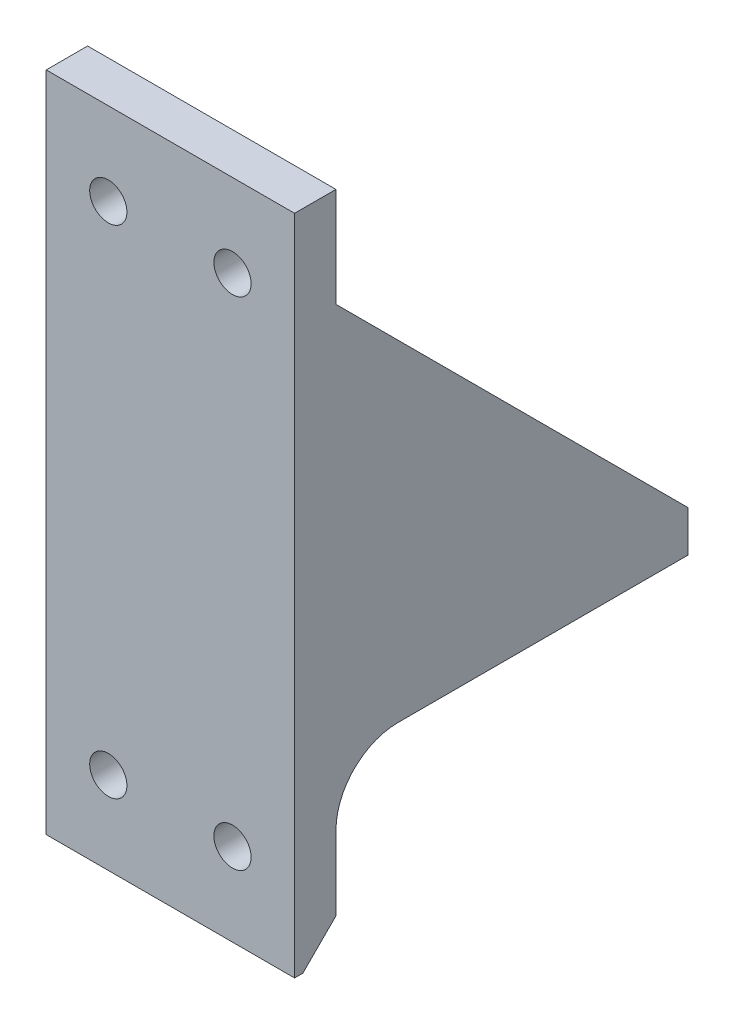
ISO-10303-21;
HEADER;
FILE_DESCRIPTION(('STEP AP214'),'2;1');
FILE_NAME('part.step','',(''),(''),'','','');
FILE_SCHEMA(('AUTOMOTIVE_DESIGN { 1 0 10303 214 1 1 1 1 }'));
ENDSEC;
DATA;
#1=APPLICATION_CONTEXT('core data for automotive mechanical design processes');
#2=APPLICATION_PROTOCOL_DEFINITION('international standard','automotive_design',2000,#1);
#3=PRODUCT_CONTEXT('',#1,'mechanical');
#4=PRODUCT('Part','Part','',(#3));
#5=PRODUCT_RELATED_PRODUCT_CATEGORY('part','',(#4));
#6=PRODUCT_DEFINITION_FORMATION('','',#4);
#7=PRODUCT_DEFINITION_CONTEXT('part definition',#1,'design');
#8=PRODUCT_DEFINITION('design','',#6,#7);
#9=PRODUCT_DEFINITION_SHAPE('','',#8);
#10=(LENGTH_UNIT() NAMED_UNIT(*) SI_UNIT(.MILLI.,.METRE.));
#11=(NAMED_UNIT(*) PLANE_ANGLE_UNIT() SI_UNIT($,.RADIAN.));
#12=(NAMED_UNIT(*) SI_UNIT($,.STERADIAN.) SOLID_ANGLE_UNIT());
#13=UNCERTAINTY_MEASURE_WITH_UNIT(LENGTH_MEASURE(1.E-05),#10,'distance_accuracy_value','');
#14=(GEOMETRIC_REPRESENTATION_CONTEXT(3) GLOBAL_UNCERTAINTY_ASSIGNED_CONTEXT((#13)) GLOBAL_UNIT_ASSIGNED_CONTEXT((#10,
#11,#12)) REPRESENTATION_CONTEXT('',''));
#15=CARTESIAN_POINT('',(0.,0.,0.));
#16=DIRECTION('',(0.,0.,1.));
#17=DIRECTION('',(1.,0.,0.));
#18=AXIS2_PLACEMENT_3D('',#15,#16,#17);
#19=CARTESIAN_POINT('',(157.475487839819,-29.048,-85.));
#20=DIRECTION('',(0.,-0.707106781186552,0.707106781186544));
#21=DIRECTION('',(0.,-0.707106781186544,-0.707106781186552));
#22=AXIS2_PLACEMENT_3D('',#19,#20,#21);
#23=PLANE('',#22);
#24=CARTESIAN_POINT('',(10.31875,21.1957499999994,-34.75625));
#25=DIRECTION('',(0.,-0.707106781186552,0.707106781186544));
#26=DIRECTION('',(0.,0.707106781186544,0.707106781186552));
#27=AXIS2_PLACEMENT_3D('',#24,#25,#26);
#28=ELLIPSE('',#27,10.6066017177981,7.5);
#29=CARTESIAN_POINT('',(10.31875,28.6957499999993,-27.25625));
#30=VERTEX_POINT('',#29);
#31=EDGE_CURVE('E279',#30,#30,#28,.T.);
#32=ORIENTED_EDGE('',*,*,#31,.T.);
#33=EDGE_LOOP('',(#32));
#34=FACE_BOUND('',#33,.T.);
#35=CARTESIAN_POINT('',(10.31875,-18.4917500000001,-74.44375));
#36=DIRECTION('',(0.,-0.707106781186552,0.707106781186544));
#37=DIRECTION('',(0.,0.707106781186544,0.707106781186552));
#38=AXIS2_PLACEMENT_3D('',#35,#36,#37);
#39=ELLIPSE('',#38,10.6066017177982,7.5);
#40=CARTESIAN_POINT('',(10.31875,-10.9917500000002,-66.94375));
#41=VERTEX_POINT('',#40);
#42=EDGE_CURVE('E275',#41,#41,#39,.T.);
#43=ORIENTED_EDGE('',*,*,#42,.T.);
#44=EDGE_LOOP('',(#43));
#45=FACE_BOUND('',#44,.T.);
#46=CARTESIAN_POINT('',(-10.31875,-18.4917500000001,-74.44375));
#47=DIRECTION('',(0.,-0.707106781186552,0.707106781186544));
#48=DIRECTION('',(0.,0.707106781186544,0.707106781186552));
#49=AXIS2_PLACEMENT_3D('',#46,#47,#48);
#50=ELLIPSE('',#49,10.6066017177982,7.50000000000001);
#51=CARTESIAN_POINT('',(-10.31875,-10.9917500000002,-66.94375));
#52=VERTEX_POINT('',#51);
#53=EDGE_CURVE('E271',#52,#52,#50,.T.);
#54=ORIENTED_EDGE('',*,*,#53,.T.);
#55=EDGE_LOOP('',(#54));
#56=FACE_BOUND('',#55,.T.);
#57=CARTESIAN_POINT('',(-10.31875,21.1957499999994,-34.75625));
#58=DIRECTION('',(0.,-0.707106781186552,0.707106781186544));
#59=DIRECTION('',(0.,0.707106781186544,0.707106781186552));
#60=AXIS2_PLACEMENT_3D('',#57,#58,#59);
#61=ELLIPSE('',#60,10.6066017177982,7.5);
#62=CARTESIAN_POINT('',(-10.31875,28.6957499999993,-27.25625));
#63=VERTEX_POINT('',#62);
#64=EDGE_CURVE('E267',#63,#63,#61,.T.);
#65=ORIENTED_EDGE('',*,*,#64,.T.);
#66=EDGE_LOOP('',(#65));
#67=FACE_BOUND('',#66,.T.);
#68=CARTESIAN_POINT('',(15.,60.,4.048000000001));
#69=DIRECTION('',(0.,-0.707106781186552,0.707106781186544));
#70=DIRECTION('',(0.,0.707106781186544,0.707106781186552));
#71=AXIS2_PLACEMENT_3D('',#68,#69,#70);
#72=ELLIPSE('',#71,10.6066017177983,7.5);
#73=CARTESIAN_POINT('',(21.3137703474226,55.951999999999,0.));
#74=VERTEX_POINT('',#73);
#75=CARTESIAN_POINT('',(8.68622965257746,55.951999999999,0.));
#76=VERTEX_POINT('',#75);
#77=EDGE_CURVE('E140',#74,#76,#72,.F.);
#78=ORIENTED_EDGE('',*,*,#77,.F.);
#79=DIRECTION('',(-1.,0.,0.));
#80=VECTOR('',#79,1.);
#81=CARTESIAN_POINT('',(157.475487839819,55.951999999999,0.));
#82=LINE('',#81,#80);
#83=CARTESIAN_POINT('',(30.,55.951999999999,0.));
#84=VERTEX_POINT('',#83);
#85=EDGE_CURVE('E152',#84,#74,#82,.T.);
#86=ORIENTED_EDGE('',*,*,#85,.F.);
#87=DIRECTION('',(0.,-0.707106781186544,-0.707106781186552));
#88=VECTOR('',#87,1.);
#89=CARTESIAN_POINT('',(30.,-29.048,-85.));
#90=LINE('',#89,#88);
#91=CARTESIAN_POINT('',(30.,-29.048,-85.));
#92=VERTEX_POINT('',#91);
#93=EDGE_CURVE('E195',#84,#92,#90,.T.);
#94=ORIENTED_EDGE('',*,*,#93,.T.);
#95=DIRECTION('',(-1.,0.,0.));
#96=VECTOR('',#95,1.);
#97=CARTESIAN_POINT('',(157.475487839819,-29.048,-85.));
#98=LINE('',#97,#96);
#99=CARTESIAN_POINT('',(-30.,-29.048,-85.));
#100=VERTEX_POINT('',#99);
#101=EDGE_CURVE('E165',#92,#100,#98,.T.);
#102=ORIENTED_EDGE('',*,*,#101,.T.);
#103=DIRECTION('',(0.,-0.707106781186544,-0.707106781186552));
#104=VECTOR('',#103,1.);
#105=CARTESIAN_POINT('',(-30.,-29.048,-85.));
#106=LINE('',#105,#104);
#107=CARTESIAN_POINT('',(-30.,55.951999999999,0.));
#108=VERTEX_POINT('',#107);
#109=EDGE_CURVE('E174',#108,#100,#106,.T.);
#110=ORIENTED_EDGE('',*,*,#109,.F.);
#111=CARTESIAN_POINT('',(-21.3137703474225,55.951999999999,0.));
#112=VERTEX_POINT('',#111);
#113=EDGE_CURVE('E167',#112,#108,#82,.T.);
#114=ORIENTED_EDGE('',*,*,#113,.F.);
#115=CARTESIAN_POINT('',(-15.,60.,4.04800000000098));
#116=DIRECTION('',(0.,-0.707106781186552,0.707106781186544));
#117=DIRECTION('',(0.,0.707106781186544,0.707106781186552));
#118=AXIS2_PLACEMENT_3D('',#115,#116,#117);
#119=ELLIPSE('',#118,10.6066017177983,7.5);
#120=CARTESIAN_POINT('',(-8.68622965257744,55.951999999999,0.));
#121=VERTEX_POINT('',#120);
#122=EDGE_CURVE('E158',#121,#112,#119,.F.);
#123=ORIENTED_EDGE('',*,*,#122,.F.);
#124=EDGE_CURVE('E155',#76,#121,#82,.T.);
#125=ORIENTED_EDGE('',*,*,#124,.F.);
#126=EDGE_LOOP('',(#78,#86,#94,#102,#110,#114,#123,#125));
#127=FACE_BOUND('',#126,.T.);
#128=ADVANCED_FACE('F49',(#34,#45,#56,#67,#127),#23,.F.);
#129=CARTESIAN_POINT('',(10.31875,80.001,-34.75625));
#130=DIRECTION('',(0.,-1.,0.));
#131=DIRECTION('',(0.,0.,-1.));
#132=AXIS2_PLACEMENT_3D('',#129,#130,#131);
#133=CYLINDRICAL_SURFACE('',#132,2.38000000000001);
#134=CARTESIAN_POINT('',(10.31875,-39.048,-34.75625));
#135=DIRECTION('',(0.,-1.,0.));
#136=DIRECTION('',(0.,0.,-1.));
#137=AXIS2_PLACEMENT_3D('',#134,#135,#136);
#138=CIRCLE('',#137,2.38000000000001);
#139=CARTESIAN_POINT('',(10.31875,-39.048,-37.13625));
#140=VERTEX_POINT('',#139);
#141=EDGE_CURVE('E632',#140,#140,#138,.T.);
#142=ORIENTED_EDGE('',*,*,#141,.T.);
#143=EDGE_LOOP('',(#142));
#144=FACE_BOUND('',#143,.T.);
#145=CARTESIAN_POINT('',(10.31875,-34.048,-34.75625));
#146=DIRECTION('',(0.,1.,0.));
#147=DIRECTION('',(0.,0.,1.));
#148=AXIS2_PLACEMENT_3D('',#145,#146,#147);
#149=CIRCLE('',#148,2.38000000000001);
#150=CARTESIAN_POINT('',(10.31875,-34.048,-32.37625));
#151=VERTEX_POINT('',#150);
#152=EDGE_CURVE('E263',#151,#151,#149,.F.);
#153=ORIENTED_EDGE('',*,*,#152,.F.);
#154=EDGE_LOOP('',(#153));
#155=FACE_BOUND('',#154,.T.);
#156=ADVANCED_FACE('F330',(#144,#155),#133,.F.);
#157=CARTESIAN_POINT('',(-10.31875,80.001,-74.44375));
#158=DIRECTION('',(0.,-1.,0.));
#159=DIRECTION('',(0.,0.,-1.));
#160=AXIS2_PLACEMENT_3D('',#157,#158,#159);
#161=CYLINDRICAL_SURFACE('',#160,2.38);
#162=CARTESIAN_POINT('',(-10.31875,-39.048,-74.44375));
#163=DIRECTION('',(0.,-1.,0.));
#164=DIRECTION('',(0.,0.,-1.));
#165=AXIS2_PLACEMENT_3D('',#162,#163,#164);
#166=CIRCLE('',#165,2.38);
#167=CARTESIAN_POINT('',(-10.31875,-39.048,-76.82375));
#168=VERTEX_POINT('',#167);
#169=EDGE_CURVE('E623',#168,#168,#166,.T.);
#170=ORIENTED_EDGE('',*,*,#169,.T.);
#171=EDGE_LOOP('',(#170));
#172=FACE_BOUND('',#171,.T.);
#173=CARTESIAN_POINT('',(-10.31875,-34.048,-74.44375));
#174=DIRECTION('',(0.,1.,0.));
#175=DIRECTION('',(0.,0.,1.));
#176=AXIS2_PLACEMENT_3D('',#173,#174,#175);
#177=CIRCLE('',#176,2.38);
#178=CARTESIAN_POINT('',(-10.31875,-34.048,-72.06375));
#179=VERTEX_POINT('',#178);
#180=EDGE_CURVE('E259',#179,#179,#177,.F.);
#181=ORIENTED_EDGE('',*,*,#180,.F.);
#182=EDGE_LOOP('',(#181));
#183=FACE_BOUND('',#182,.T.);
#184=ADVANCED_FACE('F338',(#172,#183),#161,.F.);
#185=CARTESIAN_POINT('',(10.31875,80.001,-74.44375));
#186=DIRECTION('',(0.,-1.,0.));
#187=DIRECTION('',(0.,0.,-1.));
#188=AXIS2_PLACEMENT_3D('',#185,#186,#187);
#189=CYLINDRICAL_SURFACE('',#188,2.37999999999999);
#190=CARTESIAN_POINT('',(10.31875,-39.048,-74.44375));
#191=DIRECTION('',(0.,-1.,0.));
#192=DIRECTION('',(0.,0.,-1.));
#193=AXIS2_PLACEMENT_3D('',#190,#191,#192);
#194=CIRCLE('',#193,2.37999999999999);
#195=CARTESIAN_POINT('',(10.31875,-39.048,-76.82375));
#196=VERTEX_POINT('',#195);
#197=EDGE_CURVE('E627',#196,#196,#194,.T.);
#198=ORIENTED_EDGE('',*,*,#197,.T.);
#199=EDGE_LOOP('',(#198));
#200=FACE_BOUND('',#199,.T.);
#201=CARTESIAN_POINT('',(10.31875,-34.048,-74.44375));
#202=DIRECTION('',(0.,1.,0.));
#203=DIRECTION('',(0.,0.,1.));
#204=AXIS2_PLACEMENT_3D('',#201,#202,#203);
#205=CIRCLE('',#204,2.37999999999999);
#206=CARTESIAN_POINT('',(10.31875,-34.048,-72.06375));
#207=VERTEX_POINT('',#206);
#208=EDGE_CURVE('E254',#207,#207,#205,.F.);
#209=ORIENTED_EDGE('',*,*,#208,.F.);
#210=EDGE_LOOP('',(#209));
#211=FACE_BOUND('',#210,.T.);
#212=ADVANCED_FACE('F412',(#200,#211),#189,.F.);
#213=CARTESIAN_POINT('',(-10.31875,80.001,-34.75625));
#214=DIRECTION('',(0.,-1.,0.));
#215=DIRECTION('',(0.,0.,-1.));
#216=AXIS2_PLACEMENT_3D('',#213,#214,#215);
#217=CYLINDRICAL_SURFACE('',#216,2.38);
#218=CARTESIAN_POINT('',(-10.31875,-39.048,-34.75625));
#219=DIRECTION('',(0.,-1.,0.));
#220=DIRECTION('',(0.,0.,-1.));
#221=AXIS2_PLACEMENT_3D('',#218,#219,#220);
#222=CIRCLE('',#221,2.38);
#223=CARTESIAN_POINT('',(-10.31875,-39.048,-37.13625));
#224=VERTEX_POINT('',#223);
#225=EDGE_CURVE('E628',#224,#224,#222,.T.);
#226=ORIENTED_EDGE('',*,*,#225,.T.);
#227=EDGE_LOOP('',(#226));
#228=FACE_BOUND('',#227,.T.);
#229=CARTESIAN_POINT('',(-10.31875,-34.048,-34.75625));
#230=DIRECTION('',(0.,1.,0.));
#231=DIRECTION('',(0.,0.,1.));
#232=AXIS2_PLACEMENT_3D('',#229,#230,#231);
#233=CIRCLE('',#232,2.38);
#234=CARTESIAN_POINT('',(-10.31875,-34.048,-32.37625));
#235=VERTEX_POINT('',#234);
#236=EDGE_CURVE('E250',#235,#235,#233,.F.);
#237=ORIENTED_EDGE('',*,*,#236,.F.);
#238=EDGE_LOOP('',(#237));
#239=FACE_BOUND('',#238,.T.);
#240=ADVANCED_FACE('F420',(#228,#239),#217,.F.);
#241=CARTESIAN_POINT('',(0.,0.,0.));
#242=DIRECTION('',(0.,0.,-1.));
#243=DIRECTION('',(-1.,0.,0.));
#244=AXIS2_PLACEMENT_3D('',#241,#242,#243);
#245=PLANE('',#244);
#246=ORIENTED_EDGE('',*,*,#85,.T.);
#247=CARTESIAN_POINT('',(15.,60.,0.));
#248=DIRECTION('',(0.,0.,-1.));
#249=DIRECTION('',(-1.,0.,0.));
#250=AXIS2_PLACEMENT_3D('',#247,#248,#249);
#251=CIRCLE('',#250,7.5);
#252=EDGE_CURVE('E137',#74,#76,#251,.T.);
#253=ORIENTED_EDGE('',*,*,#252,.T.);
#254=ORIENTED_EDGE('',*,*,#124,.T.);
#255=CARTESIAN_POINT('',(-15.,60.,0.));
#256=DIRECTION('',(0.,0.,-1.));
#257=DIRECTION('',(-1.,0.,0.));
#258=AXIS2_PLACEMENT_3D('',#255,#256,#257);
#259=CIRCLE('',#258,7.5);
#260=EDGE_CURVE('E147',#121,#112,#259,.T.);
#261=ORIENTED_EDGE('',*,*,#260,.T.);
#262=ORIENTED_EDGE('',*,*,#113,.T.);
#263=DIRECTION('',(0.,-1.,0.));
#264=VECTOR('',#263,1.);
#265=CARTESIAN_POINT('',(-30.,-80.,0.));
#266=LINE('',#265,#264);
#267=CARTESIAN_POINT('',(-30.,80.,0.));
#268=VERTEX_POINT('',#267);
#269=EDGE_CURVE('E216',#268,#108,#266,.T.);
#270=ORIENTED_EDGE('',*,*,#269,.F.);
#271=DIRECTION('',(-1.,0.,0.));
#272=VECTOR('',#271,1.);
#273=CARTESIAN_POINT('',(-30.,80.,0.));
#274=LINE('',#273,#272);
#275=CARTESIAN_POINT('',(30.,80.,0.));
#276=VERTEX_POINT('',#275);
#277=EDGE_CURVE('E208',#276,#268,#274,.T.);
#278=ORIENTED_EDGE('',*,*,#277,.F.);
#279=DIRECTION('',(0.,1.,0.));
#280=VECTOR('',#279,1.);
#281=CARTESIAN_POINT('',(30.,-80.,0.));
#282=LINE('',#281,#280);
#283=EDGE_CURVE('E163',#84,#276,#282,.T.);
#284=ORIENTED_EDGE('',*,*,#283,.F.);
#285=EDGE_LOOP('',(#246,#253,#254,#261,#262,#270,#278,#284));
#286=FACE_BOUND('',#285,.T.);
#287=CARTESIAN_POINT('',(-15.,60.,0.));
#288=DIRECTION('',(0.,0.,-1.));
#289=DIRECTION('',(-1.,0.,0.));
#290=AXIS2_PLACEMENT_3D('',#287,#288,#289);
#291=CIRCLE('',#290,4.50000000000001);
#292=CARTESIAN_POINT('',(-19.5,60.,0.));
#293=VERTEX_POINT('',#292);
#294=EDGE_CURVE('E603',#293,#293,#291,.T.);
#295=ORIENTED_EDGE('',*,*,#294,.F.);
#296=EDGE_LOOP('',(#295));
#297=FACE_BOUND('',#296,.T.);
#298=CARTESIAN_POINT('',(15.,60.,0.));
#299=DIRECTION('',(0.,0.,-1.));
#300=DIRECTION('',(-1.,0.,0.));
#301=AXIS2_PLACEMENT_3D('',#298,#299,#300);
#302=CIRCLE('',#301,4.50000000000001);
#303=CARTESIAN_POINT('',(10.5,60.,0.));
#304=VERTEX_POINT('',#303);
#305=EDGE_CURVE('E597',#304,#304,#302,.T.);
#306=ORIENTED_EDGE('',*,*,#305,.F.);
#307=EDGE_LOOP('',(#306));
#308=FACE_BOUND('',#307,.T.);
#309=ADVANCED_FACE('F160',(#286,#297,#308),#245,.T.);
#310=CARTESIAN_POINT('',(30.,-80.,10.));
#311=DIRECTION('',(-1.,0.,0.));
#312=DIRECTION('',(0.,0.,1.));
#313=AXIS2_PLACEMENT_3D('',#310,#311,#312);
#314=PLANE('',#313);
#315=DIRECTION('',(0.,0.,-1.));
#316=VECTOR('',#315,1.);
#317=CARTESIAN_POINT('',(30.,-80.,10.));
#318=LINE('',#317,#316);
#319=CARTESIAN_POINT('',(30.,-80.,10.));
#320=VERTEX_POINT('',#319);
#321=CARTESIAN_POINT('',(30.,-80.,8.00000000000004));
#322=VERTEX_POINT('',#321);
#323=EDGE_CURVE('E220',#320,#322,#318,.T.);
#324=ORIENTED_EDGE('',*,*,#323,.T.);
#325=DIRECTION('',(0.,0.707106781186549,-0.707106781186546));
#326=VECTOR('',#325,1.);
#327=CARTESIAN_POINT('',(30.,-80.,8.00000000000004));
#328=LINE('',#327,#326);
#329=CARTESIAN_POINT('',(30.,-72.,0.));
#330=VERTEX_POINT('',#329);
#331=EDGE_CURVE('E240',#322,#330,#328,.T.);
#332=ORIENTED_EDGE('',*,*,#331,.T.);
#333=CARTESIAN_POINT('',(30.,-54.048,0.));
#334=VERTEX_POINT('',#333);
#335=EDGE_CURVE('E203',#330,#334,#282,.T.);
#336=ORIENTED_EDGE('',*,*,#335,.T.);
#337=CARTESIAN_POINT('',(30.,-54.048,-15.));
#338=DIRECTION('',(-1.,0.,0.));
#339=DIRECTION('',(0.,0.,1.));
#340=AXIS2_PLACEMENT_3D('',#337,#338,#339);
#341=CIRCLE('',#340,15.);
#342=CARTESIAN_POINT('',(30.,-39.048,-15.));
#343=VERTEX_POINT('',#342);
#344=EDGE_CURVE('E12',#334,#343,#341,.T.);
#345=ORIENTED_EDGE('',*,*,#344,.T.);
#346=DIRECTION('',(0.,0.,1.));
#347=VECTOR('',#346,1.);
#348=CARTESIAN_POINT('',(30.,-39.048,0.));
#349=LINE('',#348,#347);
#350=CARTESIAN_POINT('',(30.,-39.048,-85.));
#351=VERTEX_POINT('',#350);
#352=EDGE_CURVE('E194',#351,#343,#349,.T.);
#353=ORIENTED_EDGE('',*,*,#352,.F.);
#354=DIRECTION('',(0.,-1.,0.));
#355=VECTOR('',#354,1.);
#356=CARTESIAN_POINT('',(30.,-29.048,-85.));
#357=LINE('',#356,#355);
#358=EDGE_CURVE('E191',#92,#351,#357,.T.);
#359=ORIENTED_EDGE('',*,*,#358,.F.);
#360=ORIENTED_EDGE('',*,*,#93,.F.);
#361=ORIENTED_EDGE('',*,*,#283,.T.);
#362=DIRECTION('',(0.,0.,-1.));
#363=VECTOR('',#362,1.);
#364=CARTESIAN_POINT('',(30.,80.,10.));
#365=LINE('',#364,#363);
#366=CARTESIAN_POINT('',(30.,80.,10.));
#367=VERTEX_POINT('',#366);
#368=EDGE_CURVE('E232',#367,#276,#365,.T.);
#369=ORIENTED_EDGE('',*,*,#368,.F.);
#370=DIRECTION('',(0.,1.,0.));
#371=VECTOR('',#370,1.);
#372=CARTESIAN_POINT('',(30.,-80.,10.));
#373=LINE('',#372,#371);
#374=EDGE_CURVE('E219',#320,#367,#373,.T.);
#375=ORIENTED_EDGE('',*,*,#374,.F.);
#376=EDGE_LOOP('',(#324,#332,#336,#345,#353,#359,#360,#361,#369,#375));
#377=FACE_BOUND('',#376,.T.);
#378=ADVANCED_FACE('F313',(#377),#314,.F.);
#379=CARTESIAN_POINT('',(-30.,80.,10.));
#380=DIRECTION('',(0.,-1.,0.));
#381=DIRECTION('',(0.,0.,-1.));
#382=AXIS2_PLACEMENT_3D('',#379,#380,#381);
#383=PLANE('',#382);
#384=ORIENTED_EDGE('',*,*,#277,.T.);
#385=DIRECTION('',(0.,0.,-1.));
#386=VECTOR('',#385,1.);
#387=CARTESIAN_POINT('',(-30.,80.,10.));
#388=LINE('',#387,#386);
#389=CARTESIAN_POINT('',(-30.,80.,10.));
#390=VERTEX_POINT('',#389);
#391=EDGE_CURVE('E228',#390,#268,#388,.T.);
#392=ORIENTED_EDGE('',*,*,#391,.F.);
#393=DIRECTION('',(-1.,0.,0.));
#394=VECTOR('',#393,1.);
#395=CARTESIAN_POINT('',(-30.,80.,10.));
#396=LINE('',#395,#394);
#397=EDGE_CURVE('E294',#367,#390,#396,.T.);
#398=ORIENTED_EDGE('',*,*,#397,.F.);
#399=ORIENTED_EDGE('',*,*,#368,.T.);
#400=EDGE_LOOP('',(#384,#392,#398,#399));
#401=FACE_BOUND('',#400,.T.);
#402=ADVANCED_FACE('F319',(#401),#383,.F.);
#403=CARTESIAN_POINT('',(-30.,-80.,10.));
#404=DIRECTION('',(1.,0.,0.));
#405=DIRECTION('',(0.,0.,-1.));
#406=AXIS2_PLACEMENT_3D('',#403,#404,#405);
#407=PLANE('',#406);
#408=DIRECTION('',(0.,0.,1.));
#409=VECTOR('',#408,1.);
#410=CARTESIAN_POINT('',(-30.,-39.048,0.));
#411=LINE('',#410,#409);
#412=CARTESIAN_POINT('',(-30.,-39.048,-85.));
#413=VERTEX_POINT('',#412);
#414=CARTESIAN_POINT('',(-30.,-39.048,-15.));
#415=VERTEX_POINT('',#414);
#416=EDGE_CURVE('E187',#413,#415,#411,.T.);
#417=ORIENTED_EDGE('',*,*,#416,.T.);
#418=CARTESIAN_POINT('',(-30.,-54.048,-15.));
#419=DIRECTION('',(1.,0.,0.));
#420=DIRECTION('',(0.,0.,-1.));
#421=AXIS2_PLACEMENT_3D('',#418,#419,#420);
#422=CIRCLE('',#421,15.);
#423=CARTESIAN_POINT('',(-30.,-54.048,0.));
#424=VERTEX_POINT('',#423);
#425=EDGE_CURVE('E58',#415,#424,#422,.T.);
#426=ORIENTED_EDGE('',*,*,#425,.T.);
#427=CARTESIAN_POINT('',(-30.,-72.,0.));
#428=VERTEX_POINT('',#427);
#429=EDGE_CURVE('E215',#424,#428,#266,.T.);
#430=ORIENTED_EDGE('',*,*,#429,.T.);
#431=DIRECTION('',(0.,-0.707106781186549,0.707106781186546));
#432=VECTOR('',#431,1.);
#433=CARTESIAN_POINT('',(-30.,-80.,8.00000000000004));
#434=LINE('',#433,#432);
#435=CARTESIAN_POINT('',(-30.,-80.,8.00000000000004));
#436=VERTEX_POINT('',#435);
#437=EDGE_CURVE('E247',#428,#436,#434,.T.);
#438=ORIENTED_EDGE('',*,*,#437,.T.);
#439=DIRECTION('',(0.,0.,-1.));
#440=VECTOR('',#439,1.);
#441=CARTESIAN_POINT('',(-30.,-80.,10.));
#442=LINE('',#441,#440);
#443=CARTESIAN_POINT('',(-30.,-80.,10.));
#444=VERTEX_POINT('',#443);
#445=EDGE_CURVE('E224',#444,#436,#442,.T.);
#446=ORIENTED_EDGE('',*,*,#445,.F.);
#447=DIRECTION('',(0.,-1.,0.));
#448=VECTOR('',#447,1.);
#449=CARTESIAN_POINT('',(-30.,-80.,10.));
#450=LINE('',#449,#448);
#451=EDGE_CURVE('E292',#390,#444,#450,.T.);
#452=ORIENTED_EDGE('',*,*,#451,.F.);
#453=ORIENTED_EDGE('',*,*,#391,.T.);
#454=ORIENTED_EDGE('',*,*,#269,.T.);
#455=ORIENTED_EDGE('',*,*,#109,.T.);
#456=DIRECTION('',(0.,-1.,0.));
#457=VECTOR('',#456,1.);
#458=CARTESIAN_POINT('',(-30.,-29.048,-85.));
#459=LINE('',#458,#457);
#460=EDGE_CURVE('E181',#100,#413,#459,.T.);
#461=ORIENTED_EDGE('',*,*,#460,.T.);
#462=EDGE_LOOP('',(#417,#426,#430,#438,#446,#452,#453,#454,#455,#461));
#463=FACE_BOUND('',#462,.T.);
#464=ADVANCED_FACE('F300',(#463),#407,.F.);
#465=CARTESIAN_POINT('',(-30.,-80.,10.));
#466=DIRECTION('',(0.,1.,0.));
#467=DIRECTION('',(0.,0.,1.));
#468=AXIS2_PLACEMENT_3D('',#465,#466,#467);
#469=PLANE('',#468);
#470=ORIENTED_EDGE('',*,*,#445,.T.);
#471=DIRECTION('',(1.,0.,0.));
#472=VECTOR('',#471,1.);
#473=CARTESIAN_POINT('',(30.,-80.,8.00000000000004));
#474=LINE('',#473,#472);
#475=EDGE_CURVE('E236',#436,#322,#474,.T.);
#476=ORIENTED_EDGE('',*,*,#475,.T.);
#477=ORIENTED_EDGE('',*,*,#323,.F.);
#478=DIRECTION('',(1.,0.,0.));
#479=VECTOR('',#478,1.);
#480=CARTESIAN_POINT('',(-30.,-80.,10.));
#481=LINE('',#480,#479);
#482=EDGE_CURVE('E211',#444,#320,#481,.T.);
#483=ORIENTED_EDGE('',*,*,#482,.F.);
#484=EDGE_LOOP('',(#470,#476,#477,#483));
#485=FACE_BOUND('',#484,.T.);
#486=ADVANCED_FACE('F310',(#485),#469,.F.);
#487=CARTESIAN_POINT('',(0.,0.,10.));
#488=DIRECTION('',(0.,0.,-1.));
#489=DIRECTION('',(-1.,0.,0.));
#490=AXIS2_PLACEMENT_3D('',#487,#488,#489);
#491=PLANE('',#490);
#492=CARTESIAN_POINT('',(-15.,-60.,10.));
#493=DIRECTION('',(0.,0.,-1.));
#494=DIRECTION('',(-1.,0.,0.));
#495=AXIS2_PLACEMENT_3D('',#492,#493,#494);
#496=CIRCLE('',#495,4.50000000000001);
#497=CARTESIAN_POINT('',(-19.5,-60.,10.));
#498=VERTEX_POINT('',#497);
#499=EDGE_CURVE('E607',#498,#498,#496,.F.);
#500=ORIENTED_EDGE('',*,*,#499,.F.);
#501=EDGE_LOOP('',(#500));
#502=FACE_BOUND('',#501,.T.);
#503=CARTESIAN_POINT('',(15.,60.,10.));
#504=DIRECTION('',(0.,0.,-1.));
#505=DIRECTION('',(-1.,0.,0.));
#506=AXIS2_PLACEMENT_3D('',#503,#504,#505);
#507=CIRCLE('',#506,4.50000000000001);
#508=CARTESIAN_POINT('',(10.5,60.,10.));
#509=VERTEX_POINT('',#508);
#510=EDGE_CURVE('E600',#509,#509,#507,.F.);
#511=ORIENTED_EDGE('',*,*,#510,.F.);
#512=EDGE_LOOP('',(#511));
#513=FACE_BOUND('',#512,.T.);
#514=CARTESIAN_POINT('',(-15.,60.,10.));
#515=DIRECTION('',(0.,0.,-1.));
#516=DIRECTION('',(-1.,0.,0.));
#517=AXIS2_PLACEMENT_3D('',#514,#515,#516);
#518=CIRCLE('',#517,4.50000000000001);
#519=CARTESIAN_POINT('',(-19.5,60.,10.));
#520=VERTEX_POINT('',#519);
#521=EDGE_CURVE('E283',#520,#520,#518,.F.);
#522=ORIENTED_EDGE('',*,*,#521,.F.);
#523=EDGE_LOOP('',(#522));
#524=FACE_BOUND('',#523,.T.);
#525=CARTESIAN_POINT('',(15.,-60.,10.));
#526=DIRECTION('',(0.,0.,-1.));
#527=DIRECTION('',(-1.,0.,0.));
#528=AXIS2_PLACEMENT_3D('',#525,#526,#527);
#529=CIRCLE('',#528,4.50000000000001);
#530=CARTESIAN_POINT('',(10.5,-60.,10.));
#531=VERTEX_POINT('',#530);
#532=EDGE_CURVE('E619',#531,#531,#529,.F.);
#533=ORIENTED_EDGE('',*,*,#532,.F.);
#534=EDGE_LOOP('',(#533));
#535=FACE_BOUND('',#534,.T.);
#536=ORIENTED_EDGE('',*,*,#374,.T.);
#537=ORIENTED_EDGE('',*,*,#397,.T.);
#538=ORIENTED_EDGE('',*,*,#451,.T.);
#539=ORIENTED_EDGE('',*,*,#482,.T.);
#540=EDGE_LOOP('',(#536,#537,#538,#539));
#541=FACE_BOUND('',#540,.T.);
#542=ADVANCED_FACE('F315',(#502,#513,#524,#535,#541),#491,.F.);
#543=CARTESIAN_POINT('',(-15.,-60.,0.));
#544=DIRECTION('',(0.,0.,-1.));
#545=DIRECTION('',(-1.,0.,0.));
#546=AXIS2_PLACEMENT_3D('',#543,#544,#545);
#547=CIRCLE('',#546,4.50000000000001);
#548=CARTESIAN_POINT('',(-19.5,-60.,0.));
#549=VERTEX_POINT('',#548);
#550=EDGE_CURVE('E612',#549,#549,#547,.T.);
#551=ORIENTED_EDGE('',*,*,#550,.F.);
#552=EDGE_LOOP('',(#551));
#553=FACE_BOUND('',#552,.T.);
#554=CARTESIAN_POINT('',(15.,-60.,0.));
#555=DIRECTION('',(0.,0.,-1.));
#556=DIRECTION('',(-1.,0.,0.));
#557=AXIS2_PLACEMENT_3D('',#554,#555,#556);
#558=CIRCLE('',#557,4.50000000000001);
#559=CARTESIAN_POINT('',(10.5,-60.,0.));
#560=VERTEX_POINT('',#559);
#561=EDGE_CURVE('E615',#560,#560,#558,.T.);
#562=ORIENTED_EDGE('',*,*,#561,.F.);
#563=EDGE_LOOP('',(#562));
#564=FACE_BOUND('',#563,.T.);
#565=ORIENTED_EDGE('',*,*,#429,.F.);
#566=DIRECTION('',(-1.,0.,0.));
#567=VECTOR('',#566,1.);
#568=CARTESIAN_POINT('',(0.,-54.048,0.));
#569=LINE('',#568,#567);
#570=EDGE_CURVE('E71',#424,#334,#569,.F.);
#571=ORIENTED_EDGE('',*,*,#570,.T.);
#572=ORIENTED_EDGE('',*,*,#335,.F.);
#573=DIRECTION('',(-1.,0.,0.));
#574=VECTOR('',#573,1.);
#575=CARTESIAN_POINT('',(-30.,-72.,0.));
#576=LINE('',#575,#574);
#577=EDGE_CURVE('E243',#330,#428,#576,.T.);
#578=ORIENTED_EDGE('',*,*,#577,.T.);
#579=EDGE_LOOP('',(#565,#571,#572,#578));
#580=FACE_BOUND('',#579,.T.);
#581=ADVANCED_FACE('F304',(#553,#564,#580),#245,.T.);
#582=CARTESIAN_POINT('',(157.475487839819,-29.048,-85.));
#583=DIRECTION('',(0.,0.,1.));
#584=DIRECTION('',(1.,0.,0.));
#585=AXIS2_PLACEMENT_3D('',#582,#583,#584);
#586=PLANE('',#585);
#587=ORIENTED_EDGE('',*,*,#101,.F.);
#588=ORIENTED_EDGE('',*,*,#358,.T.);
#589=DIRECTION('',(-1.,0.,0.));
#590=VECTOR('',#589,1.);
#591=CARTESIAN_POINT('',(157.475487839819,-39.048,-85.));
#592=LINE('',#591,#590);
#593=EDGE_CURVE('E170',#351,#413,#592,.T.);
#594=ORIENTED_EDGE('',*,*,#593,.T.);
#595=ORIENTED_EDGE('',*,*,#460,.F.);
#596=EDGE_LOOP('',(#587,#588,#594,#595));
#597=FACE_BOUND('',#596,.T.);
#598=ADVANCED_FACE('F344',(#597),#586,.F.);
#599=CARTESIAN_POINT('',(157.475487839819,-39.048,0.));
#600=DIRECTION('',(0.,1.,0.));
#601=DIRECTION('',(0.,0.,1.));
#602=AXIS2_PLACEMENT_3D('',#599,#600,#601);
#603=PLANE('',#602);
#604=ORIENTED_EDGE('',*,*,#225,.F.);
#605=EDGE_LOOP('',(#604));
#606=FACE_BOUND('',#605,.T.);
#607=ORIENTED_EDGE('',*,*,#197,.F.);
#608=EDGE_LOOP('',(#607));
#609=FACE_BOUND('',#608,.T.);
#610=ORIENTED_EDGE('',*,*,#169,.F.);
#611=EDGE_LOOP('',(#610));
#612=FACE_BOUND('',#611,.T.);
#613=ORIENTED_EDGE('',*,*,#141,.F.);
#614=EDGE_LOOP('',(#613));
#615=FACE_BOUND('',#614,.T.);
#616=ORIENTED_EDGE('',*,*,#352,.T.);
#617=DIRECTION('',(-1.,0.,0.));
#618=VECTOR('',#617,1.);
#619=CARTESIAN_POINT('',(157.475487839819,-39.048,-15.));
#620=LINE('',#619,#618);
#621=EDGE_CURVE('E157',#343,#415,#620,.T.);
#622=ORIENTED_EDGE('',*,*,#621,.T.);
#623=ORIENTED_EDGE('',*,*,#416,.F.);
#624=ORIENTED_EDGE('',*,*,#593,.F.);
#625=EDGE_LOOP('',(#616,#622,#623,#624));
#626=FACE_BOUND('',#625,.T.);
#627=ADVANCED_FACE('F346',(#606,#609,#612,#615,#626),#603,.F.);
#628=CARTESIAN_POINT('',(-30.,-80.,8.00000000000004));
#629=DIRECTION('',(0.,-0.707106781186546,-0.707106781186549));
#630=DIRECTION('',(-1.,0.,0.));
#631=AXIS2_PLACEMENT_3D('',#628,#629,#630);
#632=PLANE('',#631);
#633=ORIENTED_EDGE('',*,*,#437,.F.);
#634=ORIENTED_EDGE('',*,*,#577,.F.);
#635=ORIENTED_EDGE('',*,*,#331,.F.);
#636=ORIENTED_EDGE('',*,*,#475,.F.);
#637=EDGE_LOOP('',(#633,#634,#635,#636));
#638=FACE_BOUND('',#637,.T.);
#639=ADVANCED_FACE('F307',(#638),#632,.T.);
#640=CARTESIAN_POINT('',(-15.,60.,10.001));
#641=DIRECTION('',(0.,0.,-1.));
#642=DIRECTION('',(-1.,0.,0.));
#643=AXIS2_PLACEMENT_3D('',#640,#641,#642);
#644=CYLINDRICAL_SURFACE('',#643,4.50000000000001);
#645=ORIENTED_EDGE('',*,*,#294,.T.);
#646=EDGE_LOOP('',(#645));
#647=FACE_BOUND('',#646,.T.);
#648=ORIENTED_EDGE('',*,*,#521,.T.);
#649=EDGE_LOOP('',(#648));
#650=FACE_BOUND('',#649,.T.);
#651=ADVANCED_FACE('F370',(#647,#650),#644,.F.);
#652=CARTESIAN_POINT('',(15.,60.,10.001));
#653=DIRECTION('',(0.,0.,-1.));
#654=DIRECTION('',(-1.,0.,0.));
#655=AXIS2_PLACEMENT_3D('',#652,#653,#654);
#656=CYLINDRICAL_SURFACE('',#655,4.50000000000001);
#657=ORIENTED_EDGE('',*,*,#305,.T.);
#658=EDGE_LOOP('',(#657));
#659=FACE_BOUND('',#658,.T.);
#660=ORIENTED_EDGE('',*,*,#510,.T.);
#661=EDGE_LOOP('',(#660));
#662=FACE_BOUND('',#661,.T.);
#663=ADVANCED_FACE('F387',(#659,#662),#656,.F.);
#664=CARTESIAN_POINT('',(15.,-60.,10.001));
#665=DIRECTION('',(0.,0.,-1.));
#666=DIRECTION('',(-1.,0.,0.));
#667=AXIS2_PLACEMENT_3D('',#664,#665,#666);
#668=CYLINDRICAL_SURFACE('',#667,4.50000000000001);
#669=ORIENTED_EDGE('',*,*,#561,.T.);
#670=EDGE_LOOP('',(#669));
#671=FACE_BOUND('',#670,.T.);
#672=ORIENTED_EDGE('',*,*,#532,.T.);
#673=EDGE_LOOP('',(#672));
#674=FACE_BOUND('',#673,.T.);
#675=ADVANCED_FACE('F382',(#671,#674),#668,.F.);
#676=CARTESIAN_POINT('',(-15.,-60.,10.001));
#677=DIRECTION('',(0.,0.,-1.));
#678=DIRECTION('',(-1.,0.,0.));
#679=AXIS2_PLACEMENT_3D('',#676,#677,#678);
#680=CYLINDRICAL_SURFACE('',#679,4.50000000000001);
#681=ORIENTED_EDGE('',*,*,#550,.T.);
#682=EDGE_LOOP('',(#681));
#683=FACE_BOUND('',#682,.T.);
#684=ORIENTED_EDGE('',*,*,#499,.T.);
#685=EDGE_LOOP('',(#684));
#686=FACE_BOUND('',#685,.T.);
#687=ADVANCED_FACE('F386',(#683,#686),#680,.F.);
#688=CARTESIAN_POINT('',(-10.31875,-60.2612034355964,-34.75625));
#689=DIRECTION('',(0.,1.,0.));
#690=DIRECTION('',(0.,0.,1.));
#691=AXIS2_PLACEMENT_3D('',#688,#689,#690);
#692=CYLINDRICAL_SURFACE('',#691,7.5);
#693=CARTESIAN_POINT('',(-10.31875,-34.048,-34.75625));
#694=DIRECTION('',(0.,1.,0.));
#695=DIRECTION('',(0.,0.,1.));
#696=AXIS2_PLACEMENT_3D('',#693,#694,#695);
#697=CIRCLE('',#696,7.5);
#698=CARTESIAN_POINT('',(-10.31875,-34.048,-27.25625));
#699=VERTEX_POINT('',#698);
#700=EDGE_CURVE('E255',#699,#699,#697,.F.);
#701=ORIENTED_EDGE('',*,*,#700,.T.);
#702=EDGE_LOOP('',(#701));
#703=FACE_BOUND('',#702,.T.);
#704=ORIENTED_EDGE('',*,*,#64,.F.);
#705=EDGE_LOOP('',(#704));
#706=FACE_BOUND('',#705,.T.);
#707=ADVANCED_FACE('F396',(#703,#706),#692,.F.);
#708=CARTESIAN_POINT('',(157.475487839819,-34.048,0.));
#709=DIRECTION('',(0.,1.,0.));
#710=DIRECTION('',(0.,0.,1.));
#711=AXIS2_PLACEMENT_3D('',#708,#709,#710);
#712=PLANE('',#711);
#713=ORIENTED_EDGE('',*,*,#700,.F.);
#714=EDGE_LOOP('',(#713));
#715=FACE_BOUND('',#714,.T.);
#716=ORIENTED_EDGE('',*,*,#236,.T.);
#717=EDGE_LOOP('',(#716));
#718=FACE_BOUND('',#717,.T.);
#719=ADVANCED_FACE('F433',(#715,#718),#712,.T.);
#720=CARTESIAN_POINT('',(10.31875,-60.2612034355964,-74.44375));
#721=DIRECTION('',(0.,1.,0.));
#722=DIRECTION('',(0.,0.,1.));
#723=AXIS2_PLACEMENT_3D('',#720,#721,#722);
#724=CYLINDRICAL_SURFACE('',#723,7.5);
#725=CARTESIAN_POINT('',(10.31875,-34.048,-74.44375));
#726=DIRECTION('',(0.,1.,0.));
#727=DIRECTION('',(0.,0.,1.));
#728=AXIS2_PLACEMENT_3D('',#725,#726,#727);
#729=CIRCLE('',#728,7.5);
#730=CARTESIAN_POINT('',(10.31875,-34.048,-66.94375));
#731=VERTEX_POINT('',#730);
#732=EDGE_CURVE('E653',#731,#731,#729,.F.);
#733=ORIENTED_EDGE('',*,*,#732,.T.);
#734=EDGE_LOOP('',(#733));
#735=FACE_BOUND('',#734,.T.);
#736=ORIENTED_EDGE('',*,*,#42,.F.);
#737=EDGE_LOOP('',(#736));
#738=FACE_BOUND('',#737,.T.);
#739=ADVANCED_FACE('F441',(#735,#738),#724,.F.);
#740=CARTESIAN_POINT('',(157.475487839819,-34.048,0.));
#741=DIRECTION('',(0.,1.,0.));
#742=DIRECTION('',(0.,0.,1.));
#743=AXIS2_PLACEMENT_3D('',#740,#741,#742);
#744=PLANE('',#743);
#745=ORIENTED_EDGE('',*,*,#732,.F.);
#746=EDGE_LOOP('',(#745));
#747=FACE_BOUND('',#746,.T.);
#748=ORIENTED_EDGE('',*,*,#208,.T.);
#749=EDGE_LOOP('',(#748));
#750=FACE_BOUND('',#749,.T.);
#751=ADVANCED_FACE('F450',(#747,#750),#744,.T.);
#752=CARTESIAN_POINT('',(-10.31875,-60.2612034355964,-74.44375));
#753=DIRECTION('',(0.,1.,0.));
#754=DIRECTION('',(0.,0.,1.));
#755=AXIS2_PLACEMENT_3D('',#752,#753,#754);
#756=CYLINDRICAL_SURFACE('',#755,7.50000000000001);
#757=CARTESIAN_POINT('',(-10.31875,-34.048,-74.44375));
#758=DIRECTION('',(0.,1.,0.));
#759=DIRECTION('',(0.,0.,1.));
#760=AXIS2_PLACEMENT_3D('',#757,#758,#759);
#761=CIRCLE('',#760,7.50000000000001);
#762=CARTESIAN_POINT('',(-10.31875,-34.048,-66.94375));
#763=VERTEX_POINT('',#762);
#764=EDGE_CURVE('E649',#763,#763,#761,.F.);
#765=ORIENTED_EDGE('',*,*,#764,.T.);
#766=EDGE_LOOP('',(#765));
#767=FACE_BOUND('',#766,.T.);
#768=ORIENTED_EDGE('',*,*,#53,.F.);
#769=EDGE_LOOP('',(#768));
#770=FACE_BOUND('',#769,.T.);
#771=ADVANCED_FACE('F459',(#767,#770),#756,.F.);
#772=CARTESIAN_POINT('',(157.475487839819,-34.048,0.));
#773=DIRECTION('',(0.,1.,0.));
#774=DIRECTION('',(0.,0.,1.));
#775=AXIS2_PLACEMENT_3D('',#772,#773,#774);
#776=PLANE('',#775);
#777=ORIENTED_EDGE('',*,*,#764,.F.);
#778=EDGE_LOOP('',(#777));
#779=FACE_BOUND('',#778,.T.);
#780=ORIENTED_EDGE('',*,*,#180,.T.);
#781=EDGE_LOOP('',(#780));
#782=FACE_BOUND('',#781,.T.);
#783=ADVANCED_FACE('F468',(#779,#782),#776,.T.);
#784=CARTESIAN_POINT('',(10.31875,-60.2612034355964,-34.75625));
#785=DIRECTION('',(0.,1.,0.));
#786=DIRECTION('',(0.,0.,1.));
#787=AXIS2_PLACEMENT_3D('',#784,#785,#786);
#788=CYLINDRICAL_SURFACE('',#787,7.5);
#789=CARTESIAN_POINT('',(10.31875,-34.048,-34.75625));
#790=DIRECTION('',(0.,1.,0.));
#791=DIRECTION('',(0.,0.,1.));
#792=AXIS2_PLACEMENT_3D('',#789,#790,#791);
#793=CIRCLE('',#792,7.5);
#794=CARTESIAN_POINT('',(10.31875,-34.048,-27.25625));
#795=VERTEX_POINT('',#794);
#796=EDGE_CURVE('E146',#795,#795,#793,.F.);
#797=ORIENTED_EDGE('',*,*,#796,.T.);
#798=EDGE_LOOP('',(#797));
#799=FACE_BOUND('',#798,.T.);
#800=ORIENTED_EDGE('',*,*,#31,.F.);
#801=EDGE_LOOP('',(#800));
#802=FACE_BOUND('',#801,.T.);
#803=ADVANCED_FACE('F477',(#799,#802),#788,.F.);
#804=CARTESIAN_POINT('',(157.475487839819,-34.048,0.));
#805=DIRECTION('',(0.,1.,0.));
#806=DIRECTION('',(0.,0.,1.));
#807=AXIS2_PLACEMENT_3D('',#804,#805,#806);
#808=PLANE('',#807);
#809=ORIENTED_EDGE('',*,*,#796,.F.);
#810=EDGE_LOOP('',(#809));
#811=FACE_BOUND('',#810,.T.);
#812=ORIENTED_EDGE('',*,*,#152,.T.);
#813=EDGE_LOOP('',(#812));
#814=FACE_BOUND('',#813,.T.);
#815=ADVANCED_FACE('F485',(#811,#814),#808,.T.);
#816=CARTESIAN_POINT('',(15.,60.,-5.));
#817=DIRECTION('',(0.,0.,1.));
#818=DIRECTION('',(1.,0.,0.));
#819=AXIS2_PLACEMENT_3D('',#816,#817,#818);
#820=CYLINDRICAL_SURFACE('',#819,7.5);
#821=ORIENTED_EDGE('',*,*,#77,.T.);
#822=ORIENTED_EDGE('',*,*,#252,.F.);
#823=EDGE_LOOP('',(#821,#822));
#824=FACE_BOUND('',#823,.T.);
#825=ADVANCED_FACE('F139',(#824),#820,.F.);
#826=CARTESIAN_POINT('',(-15.,60.,-5.));
#827=DIRECTION('',(0.,0.,1.));
#828=DIRECTION('',(1.,0.,0.));
#829=AXIS2_PLACEMENT_3D('',#826,#827,#828);
#830=CYLINDRICAL_SURFACE('',#829,7.5);
#831=ORIENTED_EDGE('',*,*,#122,.T.);
#832=ORIENTED_EDGE('',*,*,#260,.F.);
#833=EDGE_LOOP('',(#831,#832));
#834=FACE_BOUND('',#833,.T.);
#835=ADVANCED_FACE('F519',(#834),#830,.F.);
#836=CARTESIAN_POINT('',(157.475487839819,-54.048,-15.));
#837=DIRECTION('',(-1.,0.,0.));
#838=DIRECTION('',(0.,0.,1.));
#839=AXIS2_PLACEMENT_3D('',#836,#837,#838);
#840=CYLINDRICAL_SURFACE('',#839,15.);
#841=ORIENTED_EDGE('',*,*,#344,.F.);
#842=ORIENTED_EDGE('',*,*,#570,.F.);
#843=ORIENTED_EDGE('',*,*,#425,.F.);
#844=ORIENTED_EDGE('',*,*,#621,.F.);
#845=EDGE_LOOP('',(#841,#842,#843,#844));
#846=FACE_BOUND('',#845,.T.);
#847=ADVANCED_FACE('F51',(#846),#840,.F.);
#848=CLOSED_SHELL('',(#128,#156,#184,#212,#240,#309,#378,#402,#464,#486,#542,#581,#598,#627,
#639,#651,#663,#675,#687,#707,#719,#739,#751,#771,#783,#803,#815,#825,#835,#847));
#849=MANIFOLD_SOLID_BREP('B2',#848);
#850=ADVANCED_BREP_SHAPE_REPRESENTATION('',(#18,#849),#14);
#851=SHAPE_DEFINITION_REPRESENTATION(#9,#850);
ENDSEC;
END-ISO-10303-21;
